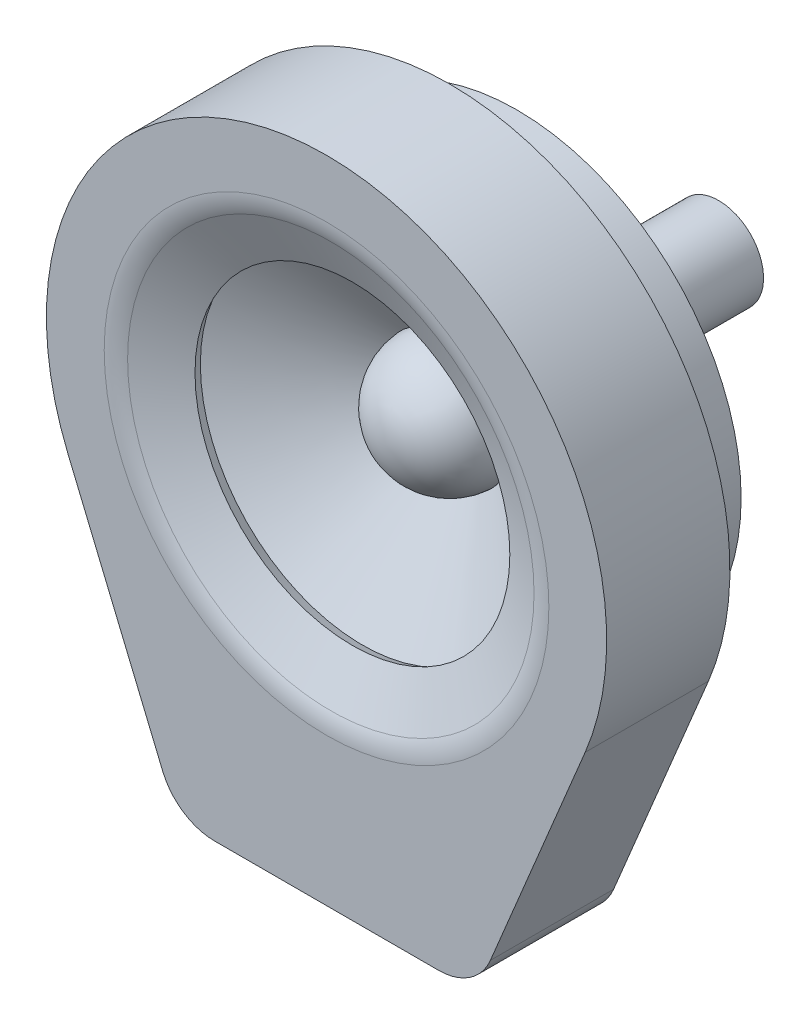
ISO-10303-21;
HEADER;
FILE_DESCRIPTION(('STEP AP214'),'2;1');
FILE_NAME('part.step','',(''),(''),'','','');
FILE_SCHEMA(('AUTOMOTIVE_DESIGN { 1 0 10303 214 1 1 1 1 }'));
ENDSEC;
DATA;
#1=APPLICATION_CONTEXT('core data for automotive mechanical design processes');
#2=APPLICATION_PROTOCOL_DEFINITION('international standard','automotive_design',2000,#1);
#3=PRODUCT_CONTEXT('',#1,'mechanical');
#4=PRODUCT('Part','Part','',(#3));
#5=PRODUCT_RELATED_PRODUCT_CATEGORY('part','',(#4));
#6=PRODUCT_DEFINITION_FORMATION('','',#4);
#7=PRODUCT_DEFINITION_CONTEXT('part definition',#1,'design');
#8=PRODUCT_DEFINITION('design','',#6,#7);
#9=PRODUCT_DEFINITION_SHAPE('','',#8);
#10=(LENGTH_UNIT() NAMED_UNIT(*) SI_UNIT(.MILLI.,.METRE.));
#11=(NAMED_UNIT(*) PLANE_ANGLE_UNIT() SI_UNIT($,.RADIAN.));
#12=(NAMED_UNIT(*) SI_UNIT($,.STERADIAN.) SOLID_ANGLE_UNIT());
#13=UNCERTAINTY_MEASURE_WITH_UNIT(LENGTH_MEASURE(1.E-05),#10,'distance_accuracy_value','');
#14=(GEOMETRIC_REPRESENTATION_CONTEXT(3) GLOBAL_UNCERTAINTY_ASSIGNED_CONTEXT((#13)) GLOBAL_UNIT_ASSIGNED_CONTEXT((#10,
#11,#12)) REPRESENTATION_CONTEXT('',''));
#15=CARTESIAN_POINT('',(0.,0.,0.));
#16=DIRECTION('',(0.,0.,1.));
#17=DIRECTION('',(1.,0.,0.));
#18=AXIS2_PLACEMENT_3D('',#15,#16,#17);
#19=CARTESIAN_POINT('',(0.,0.,0.));
#20=DIRECTION('',(0.,0.,1.));
#21=DIRECTION('',(1.,0.,0.));
#22=AXIS2_PLACEMENT_3D('',#19,#20,#21);
#23=PLANE('',#22);
#24=CARTESIAN_POINT('',(0.,0.,0.));
#25=DIRECTION('',(0.,0.,1.));
#26=DIRECTION('',(1.,0.,0.));
#27=AXIS2_PLACEMENT_3D('',#24,#25,#26);
#28=CIRCLE('',#27,12.5);
#29=CARTESIAN_POINT('',(11.5392129441462,-4.80588853695639,0.));
#30=VERTEX_POINT('',#29);
#31=CARTESIAN_POINT('',(-11.5392129441462,-4.80588853695639,0.));
#32=VERTEX_POINT('',#31);
#33=EDGE_CURVE('E141',#30,#32,#28,.T.);
#34=ORIENTED_EDGE('',*,*,#33,.F.);
#35=DIRECTION('',(0.384471082956511,0.923137035531696,0.));
#36=VECTOR('',#35,1.);
#37=CARTESIAN_POINT('',(7.30970543354696,-14.9611777073913,0.));
#38=LINE('',#37,#36);
#39=CARTESIAN_POINT('',(7.30970543354696,-14.9611777073913,0.));
#40=VERTEX_POINT('',#39);
#41=EDGE_CURVE('E66',#40,#30,#38,.T.);
#42=ORIENTED_EDGE('',*,*,#41,.F.);
#43=CARTESIAN_POINT('',(5.00186284471772,-14.,0.));
#44=DIRECTION('',(0.,0.,1.));
#45=DIRECTION('',(1.,0.,0.));
#46=AXIS2_PLACEMENT_3D('',#43,#44,#45);
#47=CIRCLE('',#46,2.5);
#48=CARTESIAN_POINT('',(5.00186284471772,-16.5,0.));
#49=VERTEX_POINT('',#48);
#50=EDGE_CURVE('E226',#49,#40,#47,.T.);
#51=ORIENTED_EDGE('',*,*,#50,.F.);
#52=DIRECTION('',(1.,0.,0.));
#53=VECTOR('',#52,1.);
#54=CARTESIAN_POINT('',(-5.00186284471772,-16.5,0.));
#55=LINE('',#54,#53);
#56=CARTESIAN_POINT('',(-5.00186284471771,-16.5,0.));
#57=VERTEX_POINT('',#56);
#58=EDGE_CURVE('E224',#57,#49,#55,.T.);
#59=ORIENTED_EDGE('',*,*,#58,.F.);
#60=CARTESIAN_POINT('',(-5.00186284471772,-14.,0.));
#61=DIRECTION('',(0.,0.,1.));
#62=DIRECTION('',(1.,0.,0.));
#63=AXIS2_PLACEMENT_3D('',#60,#61,#62);
#64=CIRCLE('',#63,2.5);
#65=CARTESIAN_POINT('',(-7.30970543354696,-14.9611777073913,0.));
#66=VERTEX_POINT('',#65);
#67=EDGE_CURVE('E222',#66,#57,#64,.T.);
#68=ORIENTED_EDGE('',*,*,#67,.F.);
#69=DIRECTION('',(0.384471082956511,-0.923137035531696,0.));
#70=VECTOR('',#69,1.);
#71=CARTESIAN_POINT('',(-7.30970543354696,-14.9611777073913,0.));
#72=LINE('',#71,#70);
#73=EDGE_CURVE('E220',#32,#66,#72,.T.);
#74=ORIENTED_EDGE('',*,*,#73,.F.);
#75=EDGE_LOOP('',(#34,#42,#51,#59,#68,#74));
#76=FACE_BOUND('',#75,.T.);
#77=CARTESIAN_POINT('',(0.,0.,0.));
#78=DIRECTION('',(0.,0.,1.));
#79=DIRECTION('',(1.,0.,0.));
#80=AXIS2_PLACEMENT_3D('',#77,#78,#79);
#81=CIRCLE('',#80,12.);
#82=CARTESIAN_POINT('',(11.0776444263804,-4.61365299547813,0.));
#83=VERTEX_POINT('',#82);
#84=CARTESIAN_POINT('',(-11.0776444263804,-4.61365299547814,0.));
#85=VERTEX_POINT('',#84);
#86=EDGE_CURVE('E58',#83,#85,#81,.T.);
#87=ORIENTED_EDGE('',*,*,#86,.T.);
#88=DIRECTION('',(0.384471082956511,-0.923137035531696,0.));
#89=VECTOR('',#88,1.);
#90=CARTESIAN_POINT('',(-6.84813691578111,-14.768942165913,0.));
#91=LINE('',#90,#89);
#92=CARTESIAN_POINT('',(-6.84813691578111,-14.768942165913,0.));
#93=VERTEX_POINT('',#92);
#94=EDGE_CURVE('E174',#85,#93,#91,.T.);
#95=ORIENTED_EDGE('',*,*,#94,.T.);
#96=CARTESIAN_POINT('',(-5.00186284471772,-14.,0.));
#97=DIRECTION('',(0.,0.,1.));
#98=DIRECTION('',(1.,0.,0.));
#99=AXIS2_PLACEMENT_3D('',#96,#97,#98);
#100=CIRCLE('',#99,2.);
#101=CARTESIAN_POINT('',(-5.00186284471772,-16.,0.));
#102=VERTEX_POINT('',#101);
#103=EDGE_CURVE('E177',#93,#102,#100,.T.);
#104=ORIENTED_EDGE('',*,*,#103,.T.);
#105=DIRECTION('',(1.,0.,0.));
#106=VECTOR('',#105,1.);
#107=CARTESIAN_POINT('',(-5.00186284471772,-16.,0.));
#108=LINE('',#107,#106);
#109=CARTESIAN_POINT('',(5.00186284471772,-16.,0.));
#110=VERTEX_POINT('',#109);
#111=EDGE_CURVE('E180',#102,#110,#108,.T.);
#112=ORIENTED_EDGE('',*,*,#111,.T.);
#113=CARTESIAN_POINT('',(5.00186284471772,-14.,0.));
#114=DIRECTION('',(0.,0.,1.));
#115=DIRECTION('',(1.,0.,0.));
#116=AXIS2_PLACEMENT_3D('',#113,#114,#115);
#117=CIRCLE('',#116,2.);
#118=CARTESIAN_POINT('',(6.84813691578111,-14.768942165913,0.));
#119=VERTEX_POINT('',#118);
#120=EDGE_CURVE('E183',#110,#119,#117,.T.);
#121=ORIENTED_EDGE('',*,*,#120,.T.);
#122=DIRECTION('',(0.384471082956511,0.923137035531696,0.));
#123=VECTOR('',#122,1.);
#124=CARTESIAN_POINT('',(6.84813691578111,-14.768942165913,0.));
#125=LINE('',#124,#123);
#126=EDGE_CURVE('E186',#119,#83,#125,.T.);
#127=ORIENTED_EDGE('',*,*,#126,.T.);
#128=EDGE_LOOP('',(#87,#95,#104,#112,#121,#127));
#129=FACE_BOUND('',#128,.T.);
#130=ADVANCED_FACE('F43',(#76,#129),#23,.F.);
#131=CARTESIAN_POINT('',(0.,0.,5.));
#132=DIRECTION('',(0.,0.,-1.));
#133=DIRECTION('',(-1.,0.,0.));
#134=AXIS2_PLACEMENT_3D('',#131,#132,#133);
#135=CYLINDRICAL_SURFACE('',#134,12.5);
#136=ORIENTED_EDGE('',*,*,#33,.T.);
#137=DIRECTION('',(0.,0.,-1.));
#138=VECTOR('',#137,1.);
#139=CARTESIAN_POINT('',(-11.5392129441462,-4.80588853695639,5.));
#140=LINE('',#139,#138);
#141=CARTESIAN_POINT('',(-11.5392129441462,-4.80588853695639,5.5));
#142=VERTEX_POINT('',#141);
#143=EDGE_CURVE('E136',#142,#32,#140,.T.);
#144=ORIENTED_EDGE('',*,*,#143,.F.);
#145=CARTESIAN_POINT('',(0.,0.,5.5));
#146=DIRECTION('',(0.,0.,1.));
#147=DIRECTION('',(1.,0.,0.));
#148=AXIS2_PLACEMENT_3D('',#145,#146,#147);
#149=CIRCLE('',#148,12.5);
#150=CARTESIAN_POINT('',(11.5392129441462,-4.80588853695639,5.5));
#151=VERTEX_POINT('',#150);
#152=EDGE_CURVE('E139',#151,#142,#149,.T.);
#153=ORIENTED_EDGE('',*,*,#152,.F.);
#154=DIRECTION('',(0.,0.,-1.));
#155=VECTOR('',#154,1.);
#156=CARTESIAN_POINT('',(11.5392129441462,-4.80588853695639,5.));
#157=LINE('',#156,#155);
#158=EDGE_CURVE('E229',#151,#30,#157,.T.);
#159=ORIENTED_EDGE('',*,*,#158,.T.);
#160=EDGE_LOOP('',(#136,#144,#153,#159));
#161=FACE_BOUND('',#160,.T.);
#162=ADVANCED_FACE('F45',(#161),#135,.T.);
#163=CARTESIAN_POINT('',(-7.30970543354696,-14.9611777073913,5.));
#164=DIRECTION('',(0.923137035531696,0.384471082956511,0.));
#165=DIRECTION('',(-0.384471082956511,0.923137035531696,0.));
#166=AXIS2_PLACEMENT_3D('',#163,#164,#165);
#167=PLANE('',#166);
#168=ORIENTED_EDGE('',*,*,#73,.T.);
#169=DIRECTION('',(0.,0.,-1.));
#170=VECTOR('',#169,1.);
#171=CARTESIAN_POINT('',(-7.30970543354696,-14.9611777073913,5.));
#172=LINE('',#171,#170);
#173=CARTESIAN_POINT('',(-7.30970543354696,-14.9611777073913,5.5));
#174=VERTEX_POINT('',#173);
#175=EDGE_CURVE('E143',#174,#66,#172,.T.);
#176=ORIENTED_EDGE('',*,*,#175,.F.);
#177=DIRECTION('',(0.384471082956511,-0.923137035531696,0.));
#178=VECTOR('',#177,1.);
#179=CARTESIAN_POINT('',(-11.5392129441462,-4.80588853695639,5.5));
#180=LINE('',#179,#178);
#181=EDGE_CURVE('E146',#142,#174,#180,.T.);
#182=ORIENTED_EDGE('',*,*,#181,.F.);
#183=ORIENTED_EDGE('',*,*,#143,.T.);
#184=EDGE_LOOP('',(#168,#176,#182,#183));
#185=FACE_BOUND('',#184,.T.);
#186=ADVANCED_FACE('F147',(#185),#167,.F.);
#187=CARTESIAN_POINT('',(-5.00186284471772,-14.,5.));
#188=DIRECTION('',(0.,0.,-1.));
#189=DIRECTION('',(-1.,0.,0.));
#190=AXIS2_PLACEMENT_3D('',#187,#188,#189);
#191=CYLINDRICAL_SURFACE('',#190,2.5);
#192=ORIENTED_EDGE('',*,*,#67,.T.);
#193=DIRECTION('',(0.,0.,-1.));
#194=VECTOR('',#193,1.);
#195=CARTESIAN_POINT('',(-5.00186284471771,-16.5,5.));
#196=LINE('',#195,#194);
#197=CARTESIAN_POINT('',(-5.00186284471772,-16.5,5.5));
#198=VERTEX_POINT('',#197);
#199=EDGE_CURVE('E236',#198,#57,#196,.T.);
#200=ORIENTED_EDGE('',*,*,#199,.F.);
#201=CARTESIAN_POINT('',(-5.00186284471772,-14.,5.5));
#202=DIRECTION('',(0.,0.,1.));
#203=DIRECTION('',(1.,0.,0.));
#204=AXIS2_PLACEMENT_3D('',#201,#202,#203);
#205=CIRCLE('',#204,2.5);
#206=EDGE_CURVE('E152',#174,#198,#205,.T.);
#207=ORIENTED_EDGE('',*,*,#206,.F.);
#208=ORIENTED_EDGE('',*,*,#175,.T.);
#209=EDGE_LOOP('',(#192,#200,#207,#208));
#210=FACE_BOUND('',#209,.T.);
#211=ADVANCED_FACE('F276',(#210),#191,.T.);
#212=CARTESIAN_POINT('',(-5.00186284471772,-16.5,5.));
#213=DIRECTION('',(0.,1.,0.));
#214=DIRECTION('',(0.,0.,1.));
#215=AXIS2_PLACEMENT_3D('',#212,#213,#214);
#216=PLANE('',#215);
#217=ORIENTED_EDGE('',*,*,#58,.T.);
#218=DIRECTION('',(0.,0.,-1.));
#219=VECTOR('',#218,1.);
#220=CARTESIAN_POINT('',(5.00186284471772,-16.5,5.));
#221=LINE('',#220,#219);
#222=CARTESIAN_POINT('',(5.00186284471772,-16.5,5.5));
#223=VERTEX_POINT('',#222);
#224=EDGE_CURVE('E233',#223,#49,#221,.T.);
#225=ORIENTED_EDGE('',*,*,#224,.F.);
#226=DIRECTION('',(1.,0.,0.));
#227=VECTOR('',#226,1.);
#228=CARTESIAN_POINT('',(-5.00186284471772,-16.5,5.5));
#229=LINE('',#228,#227);
#230=EDGE_CURVE('E167',#198,#223,#229,.T.);
#231=ORIENTED_EDGE('',*,*,#230,.F.);
#232=ORIENTED_EDGE('',*,*,#199,.T.);
#233=EDGE_LOOP('',(#217,#225,#231,#232));
#234=FACE_BOUND('',#233,.T.);
#235=ADVANCED_FACE('F272',(#234),#216,.F.);
#236=CARTESIAN_POINT('',(5.00186284471772,-14.,5.));
#237=DIRECTION('',(0.,0.,-1.));
#238=DIRECTION('',(-1.,0.,0.));
#239=AXIS2_PLACEMENT_3D('',#236,#237,#238);
#240=CYLINDRICAL_SURFACE('',#239,2.5);
#241=ORIENTED_EDGE('',*,*,#50,.T.);
#242=DIRECTION('',(0.,0.,-1.));
#243=VECTOR('',#242,1.);
#244=CARTESIAN_POINT('',(7.30970543354696,-14.9611777073913,5.));
#245=LINE('',#244,#243);
#246=CARTESIAN_POINT('',(7.30970543354696,-14.9611777073913,5.5));
#247=VERTEX_POINT('',#246);
#248=EDGE_CURVE('E231',#247,#40,#245,.T.);
#249=ORIENTED_EDGE('',*,*,#248,.F.);
#250=CARTESIAN_POINT('',(5.00186284471772,-14.,5.5));
#251=DIRECTION('',(0.,0.,1.));
#252=DIRECTION('',(1.,0.,0.));
#253=AXIS2_PLACEMENT_3D('',#250,#251,#252);
#254=CIRCLE('',#253,2.5);
#255=EDGE_CURVE('E170',#223,#247,#254,.T.);
#256=ORIENTED_EDGE('',*,*,#255,.F.);
#257=ORIENTED_EDGE('',*,*,#224,.T.);
#258=EDGE_LOOP('',(#241,#249,#256,#257));
#259=FACE_BOUND('',#258,.T.);
#260=ADVANCED_FACE('F269',(#259),#240,.T.);
#261=CARTESIAN_POINT('',(7.30970543354696,-14.9611777073913,5.));
#262=DIRECTION('',(-0.923137035531696,0.384471082956511,0.));
#263=DIRECTION('',(-0.384471082956511,-0.923137035531696,0.));
#264=AXIS2_PLACEMENT_3D('',#261,#262,#263);
#265=PLANE('',#264);
#266=ORIENTED_EDGE('',*,*,#41,.T.);
#267=ORIENTED_EDGE('',*,*,#158,.F.);
#268=DIRECTION('',(0.384471082956511,0.923137035531696,0.));
#269=VECTOR('',#268,1.);
#270=CARTESIAN_POINT('',(7.30970543354696,-14.9611777073913,5.5));
#271=LINE('',#270,#269);
#272=EDGE_CURVE('E158',#247,#151,#271,.T.);
#273=ORIENTED_EDGE('',*,*,#272,.F.);
#274=ORIENTED_EDGE('',*,*,#248,.T.);
#275=EDGE_LOOP('',(#266,#267,#273,#274));
#276=FACE_BOUND('',#275,.T.);
#277=ADVANCED_FACE('F266',(#276),#265,.F.);
#278=CARTESIAN_POINT('',(0.,0.,5.));
#279=DIRECTION('',(0.,0.,-1.));
#280=DIRECTION('',(-1.,0.,0.));
#281=AXIS2_PLACEMENT_3D('',#278,#279,#280);
#282=CYLINDRICAL_SURFACE('',#281,12.);
#283=ORIENTED_EDGE('',*,*,#86,.F.);
#284=DIRECTION('',(0.,0.,-1.));
#285=VECTOR('',#284,1.);
#286=CARTESIAN_POINT('',(11.0776444263804,-4.61365299547813,5.));
#287=LINE('',#286,#285);
#288=CARTESIAN_POINT('',(11.0776444263804,-4.61365299547813,5.));
#289=VERTEX_POINT('',#288);
#290=EDGE_CURVE('E207',#289,#83,#287,.T.);
#291=ORIENTED_EDGE('',*,*,#290,.F.);
#292=CARTESIAN_POINT('',(0.,0.,5.));
#293=DIRECTION('',(0.,0.,1.));
#294=DIRECTION('',(1.,0.,0.));
#295=AXIS2_PLACEMENT_3D('',#292,#293,#294);
#296=CIRCLE('',#295,12.);
#297=CARTESIAN_POINT('',(-11.0776444263804,-4.61365299547813,5.));
#298=VERTEX_POINT('',#297);
#299=EDGE_CURVE('E189',#289,#298,#296,.T.);
#300=ORIENTED_EDGE('',*,*,#299,.T.);
#301=DIRECTION('',(0.,0.,-1.));
#302=VECTOR('',#301,1.);
#303=CARTESIAN_POINT('',(-11.0776444263804,-4.61365299547814,5.));
#304=LINE('',#303,#302);
#305=EDGE_CURVE('E217',#298,#85,#304,.T.);
#306=ORIENTED_EDGE('',*,*,#305,.T.);
#307=EDGE_LOOP('',(#283,#291,#300,#306));
#308=FACE_BOUND('',#307,.T.);
#309=ADVANCED_FACE('F264',(#308),#282,.F.);
#310=CARTESIAN_POINT('',(-6.84813691578111,-14.768942165913,5.));
#311=DIRECTION('',(0.923137035531696,0.384471082956511,0.));
#312=DIRECTION('',(-0.384471082956511,0.923137035531696,0.));
#313=AXIS2_PLACEMENT_3D('',#310,#311,#312);
#314=PLANE('',#313);
#315=ORIENTED_EDGE('',*,*,#94,.F.);
#316=ORIENTED_EDGE('',*,*,#305,.F.);
#317=DIRECTION('',(0.384471082956511,-0.923137035531696,0.));
#318=VECTOR('',#317,1.);
#319=CARTESIAN_POINT('',(-6.84813691578111,-14.768942165913,5.));
#320=LINE('',#319,#318);
#321=CARTESIAN_POINT('',(-6.84813691578111,-14.768942165913,5.));
#322=VERTEX_POINT('',#321);
#323=EDGE_CURVE('E192',#298,#322,#320,.T.);
#324=ORIENTED_EDGE('',*,*,#323,.T.);
#325=DIRECTION('',(0.,0.,-1.));
#326=VECTOR('',#325,1.);
#327=CARTESIAN_POINT('',(-6.84813691578111,-14.768942165913,5.));
#328=LINE('',#327,#326);
#329=EDGE_CURVE('E215',#322,#93,#328,.T.);
#330=ORIENTED_EDGE('',*,*,#329,.T.);
#331=EDGE_LOOP('',(#315,#316,#324,#330));
#332=FACE_BOUND('',#331,.T.);
#333=ADVANCED_FACE('F307',(#332),#314,.T.);
#334=CARTESIAN_POINT('',(-5.00186284471772,-14.,5.));
#335=DIRECTION('',(0.,0.,-1.));
#336=DIRECTION('',(-1.,0.,0.));
#337=AXIS2_PLACEMENT_3D('',#334,#335,#336);
#338=CYLINDRICAL_SURFACE('',#337,2.);
#339=ORIENTED_EDGE('',*,*,#103,.F.);
#340=ORIENTED_EDGE('',*,*,#329,.F.);
#341=CARTESIAN_POINT('',(-5.00186284471772,-14.,5.));
#342=DIRECTION('',(0.,0.,1.));
#343=DIRECTION('',(1.,0.,0.));
#344=AXIS2_PLACEMENT_3D('',#341,#342,#343);
#345=CIRCLE('',#344,2.);
#346=CARTESIAN_POINT('',(-5.00186284471772,-16.,5.));
#347=VERTEX_POINT('',#346);
#348=EDGE_CURVE('E195',#322,#347,#345,.T.);
#349=ORIENTED_EDGE('',*,*,#348,.T.);
#350=DIRECTION('',(0.,0.,-1.));
#351=VECTOR('',#350,1.);
#352=CARTESIAN_POINT('',(-5.00186284471772,-16.,5.));
#353=LINE('',#352,#351);
#354=EDGE_CURVE('E213',#347,#102,#353,.T.);
#355=ORIENTED_EDGE('',*,*,#354,.T.);
#356=EDGE_LOOP('',(#339,#340,#349,#355));
#357=FACE_BOUND('',#356,.T.);
#358=ADVANCED_FACE('F313',(#357),#338,.F.);
#359=CARTESIAN_POINT('',(-5.00186284471772,-16.,5.));
#360=DIRECTION('',(0.,1.,0.));
#361=DIRECTION('',(0.,0.,1.));
#362=AXIS2_PLACEMENT_3D('',#359,#360,#361);
#363=PLANE('',#362);
#364=ORIENTED_EDGE('',*,*,#111,.F.);
#365=ORIENTED_EDGE('',*,*,#354,.F.);
#366=DIRECTION('',(1.,0.,0.));
#367=VECTOR('',#366,1.);
#368=CARTESIAN_POINT('',(-5.00186284471772,-16.,5.));
#369=LINE('',#368,#367);
#370=CARTESIAN_POINT('',(5.00186284471772,-16.,5.));
#371=VERTEX_POINT('',#370);
#372=EDGE_CURVE('E198',#347,#371,#369,.T.);
#373=ORIENTED_EDGE('',*,*,#372,.T.);
#374=DIRECTION('',(0.,0.,-1.));
#375=VECTOR('',#374,1.);
#376=CARTESIAN_POINT('',(5.00186284471772,-16.,5.));
#377=LINE('',#376,#375);
#378=EDGE_CURVE('E211',#371,#110,#377,.T.);
#379=ORIENTED_EDGE('',*,*,#378,.T.);
#380=EDGE_LOOP('',(#364,#365,#373,#379));
#381=FACE_BOUND('',#380,.T.);
#382=ADVANCED_FACE('F320',(#381),#363,.T.);
#383=CARTESIAN_POINT('',(5.00186284471772,-14.,5.));
#384=DIRECTION('',(0.,0.,-1.));
#385=DIRECTION('',(-1.,0.,0.));
#386=AXIS2_PLACEMENT_3D('',#383,#384,#385);
#387=CYLINDRICAL_SURFACE('',#386,2.);
#388=ORIENTED_EDGE('',*,*,#120,.F.);
#389=ORIENTED_EDGE('',*,*,#378,.F.);
#390=CARTESIAN_POINT('',(5.00186284471772,-14.,5.));
#391=DIRECTION('',(0.,0.,1.));
#392=DIRECTION('',(1.,0.,0.));
#393=AXIS2_PLACEMENT_3D('',#390,#391,#392);
#394=CIRCLE('',#393,2.);
#395=CARTESIAN_POINT('',(6.84813691578111,-14.768942165913,5.));
#396=VERTEX_POINT('',#395);
#397=EDGE_CURVE('E201',#371,#396,#394,.T.);
#398=ORIENTED_EDGE('',*,*,#397,.T.);
#399=DIRECTION('',(0.,0.,-1.));
#400=VECTOR('',#399,1.);
#401=CARTESIAN_POINT('',(6.84813691578111,-14.768942165913,5.));
#402=LINE('',#401,#400);
#403=EDGE_CURVE('E209',#396,#119,#402,.T.);
#404=ORIENTED_EDGE('',*,*,#403,.T.);
#405=EDGE_LOOP('',(#388,#389,#398,#404));
#406=FACE_BOUND('',#405,.T.);
#407=ADVANCED_FACE('F328',(#406),#387,.F.);
#408=CARTESIAN_POINT('',(6.84813691578111,-14.768942165913,5.));
#409=DIRECTION('',(-0.923137035531696,0.384471082956511,0.));
#410=DIRECTION('',(-0.384471082956511,-0.923137035531696,0.));
#411=AXIS2_PLACEMENT_3D('',#408,#409,#410);
#412=PLANE('',#411);
#413=ORIENTED_EDGE('',*,*,#126,.F.);
#414=ORIENTED_EDGE('',*,*,#403,.F.);
#415=DIRECTION('',(0.384471082956511,0.923137035531696,0.));
#416=VECTOR('',#415,1.);
#417=CARTESIAN_POINT('',(6.84813691578111,-14.768942165913,5.));
#418=LINE('',#417,#416);
#419=EDGE_CURVE('E204',#396,#289,#418,.T.);
#420=ORIENTED_EDGE('',*,*,#419,.T.);
#421=ORIENTED_EDGE('',*,*,#290,.T.);
#422=EDGE_LOOP('',(#413,#414,#420,#421));
#423=FACE_BOUND('',#422,.T.);
#424=ADVANCED_FACE('F336',(#423),#412,.T.);
#425=CARTESIAN_POINT('',(0.,0.,5.5));
#426=DIRECTION('',(0.,0.,1.));
#427=DIRECTION('',(1.,0.,0.));
#428=AXIS2_PLACEMENT_3D('',#425,#426,#427);
#429=PLANE('',#428);
#430=CARTESIAN_POINT('',(0.,0.,5.5));
#431=DIRECTION('',(0.,0.,1.));
#432=DIRECTION('',(1.,0.,0.));
#433=AXIS2_PLACEMENT_3D('',#430,#431,#432);
#434=CIRCLE('',#433,9.92109103035221);
#435=CARTESIAN_POINT('',(9.92109103035221,0.,5.5));
#436=VERTEX_POINT('',#435);
#437=EDGE_CURVE('E51',#436,#436,#434,.F.);
#438=ORIENTED_EDGE('',*,*,#437,.T.);
#439=EDGE_LOOP('',(#438));
#440=FACE_BOUND('',#439,.T.);
#441=ORIENTED_EDGE('',*,*,#152,.T.);
#442=ORIENTED_EDGE('',*,*,#181,.T.);
#443=ORIENTED_EDGE('',*,*,#206,.T.);
#444=ORIENTED_EDGE('',*,*,#230,.T.);
#445=ORIENTED_EDGE('',*,*,#255,.T.);
#446=ORIENTED_EDGE('',*,*,#272,.T.);
#447=EDGE_LOOP('',(#441,#442,#443,#444,#445,#446));
#448=FACE_BOUND('',#447,.T.);
#449=ADVANCED_FACE('F155',(#440,#448),#429,.T.);
#450=CARTESIAN_POINT('',(0.,0.,5.));
#451=DIRECTION('',(0.,0.,1.));
#452=DIRECTION('',(1.,0.,0.));
#453=AXIS2_PLACEMENT_3D('',#450,#451,#452);
#454=PLANE('',#453);
#455=ORIENTED_EDGE('',*,*,#299,.F.);
#456=ORIENTED_EDGE('',*,*,#419,.F.);
#457=ORIENTED_EDGE('',*,*,#397,.F.);
#458=ORIENTED_EDGE('',*,*,#372,.F.);
#459=ORIENTED_EDGE('',*,*,#348,.F.);
#460=ORIENTED_EDGE('',*,*,#323,.F.);
#461=EDGE_LOOP('',(#455,#456,#457,#458,#459,#460));
#462=FACE_BOUND('',#461,.T.);
#463=CARTESIAN_POINT('',(0.,0.,5.));
#464=DIRECTION('',(0.,0.,-1.));
#465=DIRECTION('',(-1.,0.,0.));
#466=AXIS2_PLACEMENT_3D('',#463,#464,#465);
#467=CIRCLE('',#466,9.58517656815572);
#468=CARTESIAN_POINT('',(-9.58517656815572,0.,5.));
#469=VERTEX_POINT('',#468);
#470=EDGE_CURVE('E159',#469,#469,#467,.T.);
#471=ORIENTED_EDGE('',*,*,#470,.F.);
#472=EDGE_LOOP('',(#471));
#473=FACE_BOUND('',#472,.T.);
#474=ADVANCED_FACE('F352',(#462,#473),#454,.F.);
#475=CARTESIAN_POINT('',(0.,0.,5.5));
#476=DIRECTION('',(0.,0.,1.));
#477=DIRECTION('',(1.,0.,0.));
#478=AXIS2_PLACEMENT_3D('',#475,#476,#477);
#479=CONICAL_SURFACE('',#478,9.47320508075689,1.13018008063184);
#480=CARTESIAN_POINT('',(0.,0.,5.30897801576319));
#481=DIRECTION('',(0.,0.,-1.));
#482=DIRECTION('',(-1.,0.,0.));
#483=AXIS2_PLACEMENT_3D('',#480,#481,#482);
#484=CIRCLE('',#483,9.06809716256332);
#485=CARTESIAN_POINT('',(-9.06809716256332,0.,5.30897801576319));
#486=VERTEX_POINT('',#485);
#487=EDGE_CURVE('E12',#486,#486,#484,.F.);
#488=ORIENTED_EDGE('',*,*,#487,.T.);
#489=EDGE_LOOP('',(#488));
#490=FACE_BOUND('',#489,.T.);
#491=CARTESIAN_POINT('',(0.,0.,4.34544749938727));
#492=DIRECTION('',(0.,0.,-1.));
#493=DIRECTION('',(-1.,0.,0.));
#494=AXIS2_PLACEMENT_3D('',#491,#492,#493);
#495=CIRCLE('',#494,7.02469968051675);
#496=CARTESIAN_POINT('',(-7.02469968051675,0.,4.34544749938727));
#497=VERTEX_POINT('',#496);
#498=EDGE_CURVE('E460',#497,#497,#495,.T.);
#499=ORIENTED_EDGE('',*,*,#498,.T.);
#500=EDGE_LOOP('',(#499));
#501=FACE_BOUND('',#500,.T.);
#502=ADVANCED_FACE('F360',(#490,#501),#479,.F.);
#503=CARTESIAN_POINT('',(0.,0.,5.));
#504=DIRECTION('',(0.,0.,1.));
#505=DIRECTION('',(1.,0.,0.));
#506=AXIS2_PLACEMENT_3D('',#503,#504,#505);
#507=CONICAL_SURFACE('',#506,9.58517656815572,1.13018008063184);
#508=CARTESIAN_POINT('',(0.,0.,3.89320299544648));
#509=DIRECTION('',(0.,0.,-1.));
#510=DIRECTION('',(-1.,0.,0.));
#511=AXIS2_PLACEMENT_3D('',#508,#509,#510);
#512=CIRCLE('',#511,7.23794814746397);
#513=CARTESIAN_POINT('',(-7.23794814746397,0.,3.89320299544648));
#514=VERTEX_POINT('',#513);
#515=EDGE_CURVE('E162',#514,#514,#512,.T.);
#516=ORIENTED_EDGE('',*,*,#515,.F.);
#517=EDGE_LOOP('',(#516));
#518=FACE_BOUND('',#517,.T.);
#519=ORIENTED_EDGE('',*,*,#470,.T.);
#520=EDGE_LOOP('',(#519));
#521=FACE_BOUND('',#520,.T.);
#522=ADVANCED_FACE('F251',(#518,#521),#507,.T.);
#523=CARTESIAN_POINT('',(0.,0.,3.89320299544648));
#524=DIRECTION('',(0.,0.,-1.));
#525=DIRECTION('',(-1.,0.,0.));
#526=AXIS2_PLACEMENT_3D('',#523,#524,#525);
#527=CONICAL_SURFACE('',#526,7.23794814746397,0.440616246163057);
#528=ORIENTED_EDGE('',*,*,#498,.F.);
#529=EDGE_LOOP('',(#528));
#530=FACE_BOUND('',#529,.T.);
#531=ORIENTED_EDGE('',*,*,#515,.T.);
#532=EDGE_LOOP('',(#531));
#533=FACE_BOUND('',#532,.T.);
#534=ADVANCED_FACE('F245',(#530,#533),#527,.F.);
#535=CARTESIAN_POINT('',(0.,0.,3.5));
#536=DIRECTION('',(0.,0.,1.));
#537=DIRECTION('',(1.,0.,0.));
#538=AXIS2_PLACEMENT_3D('',#535,#536,#537);
#539=TOROIDAL_SURFACE('',#538,9.92109103035221,2.);
#540=ORIENTED_EDGE('',*,*,#487,.F.);
#541=EDGE_LOOP('',(#540));
#542=FACE_BOUND('',#541,.T.);
#543=ORIENTED_EDGE('',*,*,#437,.F.);
#544=EDGE_LOOP('',(#543));
#545=FACE_BOUND('',#544,.T.);
#546=ADVANCED_FACE('F243',(#542,#545),#539,.T.);
#547=CLOSED_SHELL('',(#130,#162,#186,#211,#235,#260,#277,#309,#333,#358,#382,#407,#424,#449,
#474,#502,#522,#534,#546));
#548=MANIFOLD_SOLID_BREP('B2',#547);
#549=CARTESIAN_POINT('',(0.,9.,3.59171250028112));
#550=DIRECTION('',(0.,0.,-1.));
#551=DIRECTION('',(-1.,0.,0.));
#552=AXIS2_PLACEMENT_3D('',#549,#550,#551);
#553=PLANE('',#552);
#554=CARTESIAN_POINT('',(0.,0.,3.59171250028112));
#555=DIRECTION('',(0.,0.,-1.));
#556=DIRECTION('',(-1.,0.,0.));
#557=AXIS2_PLACEMENT_3D('',#554,#555,#556);
#558=CIRCLE('',#557,11.);
#559=CARTESIAN_POINT('',(-11.,0.,3.59171250028112));
#560=VERTEX_POINT('',#559);
#561=EDGE_CURVE('E42',#560,#560,#558,.T.);
#562=ORIENTED_EDGE('',*,*,#561,.T.);
#563=EDGE_LOOP('',(#562));
#564=FACE_BOUND('',#563,.T.);
#565=CARTESIAN_POINT('',(0.,0.,3.59171250028112));
#566=DIRECTION('',(0.,0.,-1.));
#567=DIRECTION('',(-1.,0.,0.));
#568=AXIS2_PLACEMENT_3D('',#565,#566,#567);
#569=CIRCLE('',#568,9.);
#570=CARTESIAN_POINT('',(-9.,0.,3.59171250028112));
#571=VERTEX_POINT('',#570);
#572=EDGE_CURVE('E510',#571,#571,#569,.T.);
#573=ORIENTED_EDGE('',*,*,#572,.F.);
#574=EDGE_LOOP('',(#573));
#575=FACE_BOUND('',#574,.T.);
#576=ADVANCED_FACE('F488',(#564,#575),#553,.T.);
#577=CARTESIAN_POINT('',(0.,0.,0.));
#578=DIRECTION('',(0.,0.,-1.));
#579=DIRECTION('',(-1.,0.,0.));
#580=AXIS2_PLACEMENT_3D('',#577,#578,#579);
#581=CYLINDRICAL_SURFACE('',#580,11.);
#582=ORIENTED_EDGE('',*,*,#561,.F.);
#583=EDGE_LOOP('',(#582));
#584=FACE_BOUND('',#583,.T.);
#585=CARTESIAN_POINT('',(0.,0.,3.69171250028112));
#586=DIRECTION('',(0.,0.,-1.));
#587=DIRECTION('',(-1.,0.,0.));
#588=AXIS2_PLACEMENT_3D('',#585,#586,#587);
#589=CIRCLE('',#588,11.);
#590=CARTESIAN_POINT('',(-11.,0.,3.69171250028112));
#591=VERTEX_POINT('',#590);
#592=EDGE_CURVE('E494',#591,#591,#589,.T.);
#593=ORIENTED_EDGE('',*,*,#592,.T.);
#594=EDGE_LOOP('',(#593));
#595=FACE_BOUND('',#594,.T.);
#596=ADVANCED_FACE('F518',(#584,#595),#581,.T.);
#597=CARTESIAN_POINT('',(0.,9.,3.69171250028112));
#598=DIRECTION('',(0.,0.,-1.));
#599=DIRECTION('',(-1.,0.,0.));
#600=AXIS2_PLACEMENT_3D('',#597,#598,#599);
#601=PLANE('',#600);
#602=ORIENTED_EDGE('',*,*,#592,.F.);
#603=EDGE_LOOP('',(#602));
#604=FACE_BOUND('',#603,.T.);
#605=CARTESIAN_POINT('',(0.,0.,3.69171250028112));
#606=DIRECTION('',(0.,0.,-1.));
#607=DIRECTION('',(-1.,0.,0.));
#608=AXIS2_PLACEMENT_3D('',#605,#606,#607);
#609=CIRCLE('',#608,8.97320508075689);
#610=CARTESIAN_POINT('',(-8.97320508075689,0.,3.69171250028112));
#611=VERTEX_POINT('',#610);
#612=EDGE_CURVE('E498',#611,#611,#609,.T.);
#613=ORIENTED_EDGE('',*,*,#612,.T.);
#614=EDGE_LOOP('',(#613));
#615=FACE_BOUND('',#614,.T.);
#616=ADVANCED_FACE('F522',(#604,#615),#601,.F.);
#617=CARTESIAN_POINT('',(0.,0.,0.170294668544282));
#618=DIRECTION('',(0.,0.,1.));
#619=DIRECTION('',(1.,0.,0.));
#620=AXIS2_PLACEMENT_3D('',#617,#618,#619);
#621=CONICAL_SURFACE('',#620,2.87393048150957,1.0471975511966);
#622=ORIENTED_EDGE('',*,*,#612,.F.);
#623=EDGE_LOOP('',(#622));
#624=FACE_BOUND('',#623,.T.);
#625=CARTESIAN_POINT('',(0.,0.,0.170294668544282));
#626=DIRECTION('',(0.,0.,-1.));
#627=DIRECTION('',(-1.,0.,0.));
#628=AXIS2_PLACEMENT_3D('',#625,#626,#627);
#629=CIRCLE('',#628,2.87393048150957);
#630=CARTESIAN_POINT('',(-2.87393048150957,0.,0.170294668544282));
#631=VERTEX_POINT('',#630);
#632=EDGE_CURVE('E502',#631,#631,#629,.T.);
#633=ORIENTED_EDGE('',*,*,#632,.T.);
#634=EDGE_LOOP('',(#633));
#635=FACE_BOUND('',#634,.T.);
#636=ADVANCED_FACE('F527',(#624,#635),#621,.F.);
#637=CARTESIAN_POINT('',(0.,0.,0.));
#638=DIRECTION('',(0.,0.,-1.));
#639=DIRECTION('',(0.,1.,0.));
#640=AXIS2_PLACEMENT_3D('',#637,#638,#639);
#641=SPHERICAL_SURFACE('',#640,2.87897146333278);
#642=ORIENTED_EDGE('',*,*,#632,.F.);
#643=EDGE_LOOP('',(#642));
#644=FACE_BOUND('',#643,.T.);
#645=ADVANCED_FACE('F533',(#644),#641,.T.);
#646=CARTESIAN_POINT('',(0.,0.,0.));
#647=DIRECTION('',(0.,0.,-1.));
#648=DIRECTION('',(0.,1.,0.));
#649=AXIS2_PLACEMENT_3D('',#646,#647,#648);
#650=SPHERICAL_SURFACE('',#649,2.77897146333278);
#651=CARTESIAN_POINT('',(0.,0.,0.));
#652=DIRECTION('',(0.,0.,-1.));
#653=DIRECTION('',(-1.,0.,0.));
#654=AXIS2_PLACEMENT_3D('',#651,#652,#653);
#655=CIRCLE('',#654,2.77897146333278);
#656=CARTESIAN_POINT('',(-2.77897146333278,0.,0.));
#657=VERTEX_POINT('',#656);
#658=EDGE_CURVE('E507',#657,#657,#655,.T.);
#659=ORIENTED_EDGE('',*,*,#658,.T.);
#660=EDGE_LOOP('',(#659));
#661=FACE_BOUND('',#660,.T.);
#662=ADVANCED_FACE('F537',(#661),#650,.F.);
#663=CARTESIAN_POINT('',(0.,0.,0.));
#664=DIRECTION('',(0.,0.,1.));
#665=DIRECTION('',(1.,0.,0.));
#666=AXIS2_PLACEMENT_3D('',#663,#664,#665);
#667=CONICAL_SURFACE('',#666,2.77897146333278,1.0471975511966);
#668=ORIENTED_EDGE('',*,*,#572,.T.);
#669=EDGE_LOOP('',(#668));
#670=FACE_BOUND('',#669,.T.);
#671=ORIENTED_EDGE('',*,*,#658,.F.);
#672=EDGE_LOOP('',(#671));
#673=FACE_BOUND('',#672,.T.);
#674=ADVANCED_FACE('F514',(#670,#673),#667,.T.);
#675=CLOSED_SHELL('',(#576,#596,#616,#636,#645,#662,#674));
#676=MANIFOLD_SOLID_BREP('B6',#675);
#677=CARTESIAN_POINT('',(0.,10.,0.));
#678=DIRECTION('',(0.,0.,1.));
#679=DIRECTION('',(1.,0.,0.));
#680=AXIS2_PLACEMENT_3D('',#677,#678,#679);
#681=PLANE('',#680);
#682=CARTESIAN_POINT('',(0.,0.,0.));
#683=DIRECTION('',(0.,0.,-1.));
#684=DIRECTION('',(-1.,0.,0.));
#685=AXIS2_PLACEMENT_3D('',#682,#683,#684);
#686=CIRCLE('',#685,10.);
#687=CARTESIAN_POINT('',(-10.,0.,0.));
#688=VERTEX_POINT('',#687);
#689=EDGE_CURVE('E487',#688,#688,#686,.T.);
#690=ORIENTED_EDGE('',*,*,#689,.F.);
#691=EDGE_LOOP('',(#690));
#692=FACE_BOUND('',#691,.T.);
#693=ADVANCED_FACE('F588',(#692),#681,.T.);
#694=CARTESIAN_POINT('',(0.,0.,0.));
#695=DIRECTION('',(0.,0.,-1.));
#696=DIRECTION('',(-1.,0.,0.));
#697=AXIS2_PLACEMENT_3D('',#694,#695,#696);
#698=CYLINDRICAL_SURFACE('',#697,10.);
#699=ORIENTED_EDGE('',*,*,#689,.T.);
#700=EDGE_LOOP('',(#699));
#701=FACE_BOUND('',#700,.T.);
#702=CARTESIAN_POINT('',(0.,0.,-3.));
#703=DIRECTION('',(0.,0.,-1.));
#704=DIRECTION('',(-1.,0.,0.));
#705=AXIS2_PLACEMENT_3D('',#702,#703,#704);
#706=CIRCLE('',#705,10.);
#707=CARTESIAN_POINT('',(-10.,0.,-3.));
#708=VERTEX_POINT('',#707);
#709=EDGE_CURVE('E594',#708,#708,#706,.T.);
#710=ORIENTED_EDGE('',*,*,#709,.F.);
#711=EDGE_LOOP('',(#710));
#712=FACE_BOUND('',#711,.T.);
#713=ADVANCED_FACE('F620',(#701,#712),#698,.T.);
#714=CARTESIAN_POINT('',(0.,2.,-3.));
#715=DIRECTION('',(0.,0.,-1.));
#716=DIRECTION('',(-1.,0.,0.));
#717=AXIS2_PLACEMENT_3D('',#714,#715,#716);
#718=PLANE('',#717);
#719=ORIENTED_EDGE('',*,*,#709,.T.);
#720=EDGE_LOOP('',(#719));
#721=FACE_BOUND('',#720,.T.);
#722=CARTESIAN_POINT('',(0.,0.,-3.));
#723=DIRECTION('',(0.,0.,-1.));
#724=DIRECTION('',(-1.,0.,0.));
#725=AXIS2_PLACEMENT_3D('',#722,#723,#724);
#726=CIRCLE('',#725,2.);
#727=CARTESIAN_POINT('',(-2.,0.,-3.));
#728=VERTEX_POINT('',#727);
#729=EDGE_CURVE('E598',#728,#728,#726,.T.);
#730=ORIENTED_EDGE('',*,*,#729,.F.);
#731=EDGE_LOOP('',(#730));
#732=FACE_BOUND('',#731,.T.);
#733=ADVANCED_FACE('F612',(#721,#732),#718,.T.);
#734=CARTESIAN_POINT('',(0.,0.,0.));
#735=DIRECTION('',(0.,0.,-1.));
#736=DIRECTION('',(-1.,0.,0.));
#737=AXIS2_PLACEMENT_3D('',#734,#735,#736);
#738=CYLINDRICAL_SURFACE('',#737,2.);
#739=ORIENTED_EDGE('',*,*,#729,.T.);
#740=EDGE_LOOP('',(#739));
#741=FACE_BOUND('',#740,.T.);
#742=CARTESIAN_POINT('',(0.,0.,-12.));
#743=DIRECTION('',(0.,0.,-1.));
#744=DIRECTION('',(-1.,0.,0.));
#745=AXIS2_PLACEMENT_3D('',#742,#743,#744);
#746=CIRCLE('',#745,2.);
#747=CARTESIAN_POINT('',(-2.,0.,-12.));
#748=VERTEX_POINT('',#747);
#749=EDGE_CURVE('E602',#748,#748,#746,.T.);
#750=ORIENTED_EDGE('',*,*,#749,.F.);
#751=EDGE_LOOP('',(#750));
#752=FACE_BOUND('',#751,.T.);
#753=ADVANCED_FACE('F610',(#741,#752),#738,.T.);
#754=CARTESIAN_POINT('',(0.,0.,-12.));
#755=DIRECTION('',(0.,0.,-1.));
#756=DIRECTION('',(-1.,0.,0.));
#757=AXIS2_PLACEMENT_3D('',#754,#755,#756);
#758=PLANE('',#757);
#759=ORIENTED_EDGE('',*,*,#749,.T.);
#760=EDGE_LOOP('',(#759));
#761=FACE_BOUND('',#760,.T.);
#762=ADVANCED_FACE('F608',(#761),#758,.T.);
#763=CLOSED_SHELL('',(#693,#713,#733,#753,#762));
#764=MANIFOLD_SOLID_BREP('B37',#763);
#765=ADVANCED_BREP_SHAPE_REPRESENTATION('',(#18,#548,#676,#764),#14);
#766=SHAPE_DEFINITION_REPRESENTATION(#9,#765);
ENDSEC;
END-ISO-10303-21;
